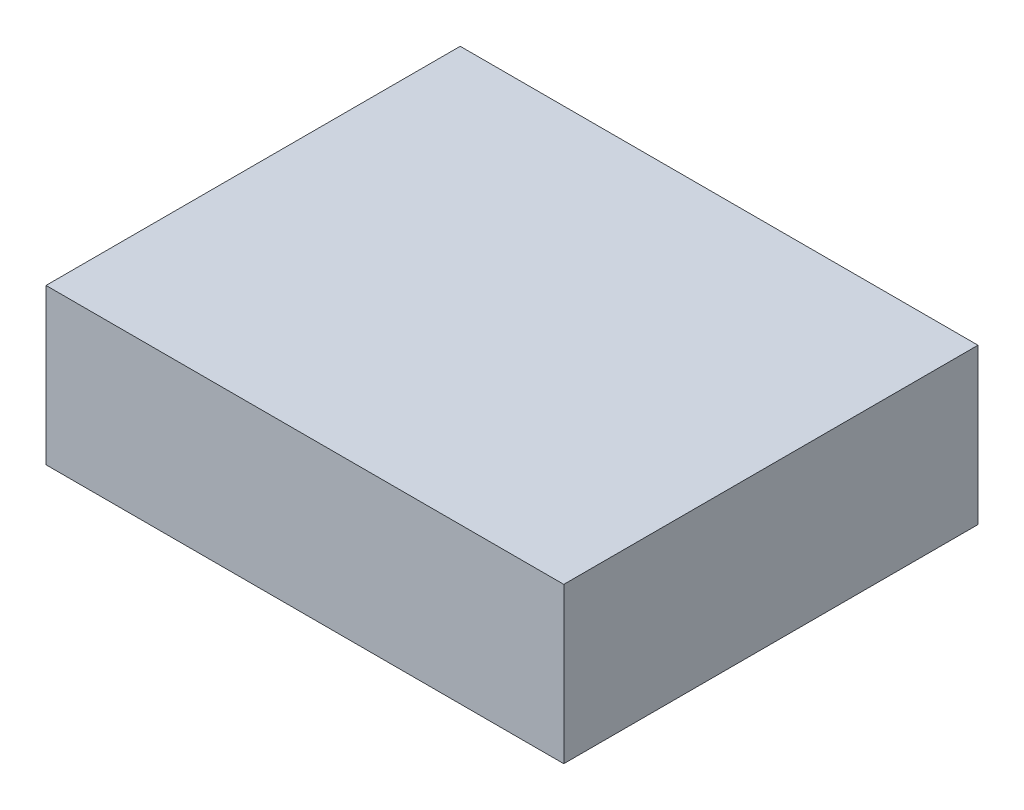
ISO-10303-21;
HEADER;
FILE_DESCRIPTION(('STEP AP214'),'2;1');
FILE_NAME('part.step','',(''),(''),'','','');
FILE_SCHEMA(('AUTOMOTIVE_DESIGN { 1 0 10303 214 1 1 1 1 }'));
ENDSEC;
DATA;
#1=APPLICATION_CONTEXT('core data for automotive mechanical design processes');
#2=APPLICATION_PROTOCOL_DEFINITION('international standard','automotive_design',2000,#1);
#3=PRODUCT_CONTEXT('',#1,'mechanical');
#4=PRODUCT('Part','Part','',(#3));
#5=PRODUCT_RELATED_PRODUCT_CATEGORY('part','',(#4));
#6=PRODUCT_DEFINITION_FORMATION('','',#4);
#7=PRODUCT_DEFINITION_CONTEXT('part definition',#1,'design');
#8=PRODUCT_DEFINITION('design','',#6,#7);
#9=PRODUCT_DEFINITION_SHAPE('','',#8);
#10=(LENGTH_UNIT() NAMED_UNIT(*) SI_UNIT(.MILLI.,.METRE.));
#11=(NAMED_UNIT(*) PLANE_ANGLE_UNIT() SI_UNIT($,.RADIAN.));
#12=(NAMED_UNIT(*) SI_UNIT($,.STERADIAN.) SOLID_ANGLE_UNIT());
#13=UNCERTAINTY_MEASURE_WITH_UNIT(LENGTH_MEASURE(1.E-05),#10,'distance_accuracy_value','');
#14=(GEOMETRIC_REPRESENTATION_CONTEXT(3) GLOBAL_UNCERTAINTY_ASSIGNED_CONTEXT((#13)) GLOBAL_UNIT_ASSIGNED_CONTEXT((#10,
#11,#12)) REPRESENTATION_CONTEXT('',''));
#15=CARTESIAN_POINT('',(0.,0.,0.));
#16=DIRECTION('',(0.,0.,1.));
#17=DIRECTION('',(1.,0.,0.));
#18=AXIS2_PLACEMENT_3D('',#15,#16,#17);
#19=CARTESIAN_POINT('',(-50.,30.,40.));
#20=DIRECTION('',(1.,0.,0.));
#21=DIRECTION('',(0.,0.,-1.));
#22=AXIS2_PLACEMENT_3D('',#19,#20,#21);
#23=PLANE('',#22);
#24=DIRECTION('',(0.,0.,1.));
#25=VECTOR('',#24,1.);
#26=CARTESIAN_POINT('',(-50.,0.,40.));
#27=LINE('',#26,#25);
#28=CARTESIAN_POINT('',(-50.,0.,-40.));
#29=VERTEX_POINT('',#28);
#30=CARTESIAN_POINT('',(-50.,0.,40.));
#31=VERTEX_POINT('',#30);
#32=EDGE_CURVE('E96',#29,#31,#27,.T.);
#33=ORIENTED_EDGE('',*,*,#32,.T.);
#34=DIRECTION('',(0.,-1.,0.));
#35=VECTOR('',#34,1.);
#36=CARTESIAN_POINT('',(-50.,30.,40.));
#37=LINE('',#36,#35);
#38=CARTESIAN_POINT('',(-50.,30.,40.));
#39=VERTEX_POINT('',#38);
#40=EDGE_CURVE('E11',#39,#31,#37,.T.);
#41=ORIENTED_EDGE('',*,*,#40,.F.);
#42=DIRECTION('',(0.,0.,1.));
#43=VECTOR('',#42,1.);
#44=CARTESIAN_POINT('',(-50.,30.,40.));
#45=LINE('',#44,#43);
#46=CARTESIAN_POINT('',(-50.,30.,-40.));
#47=VERTEX_POINT('',#46);
#48=EDGE_CURVE('E84',#47,#39,#45,.T.);
#49=ORIENTED_EDGE('',*,*,#48,.F.);
#50=DIRECTION('',(0.,-1.,0.));
#51=VECTOR('',#50,1.);
#52=CARTESIAN_POINT('',(-50.,30.,-40.));
#53=LINE('',#52,#51);
#54=EDGE_CURVE('E92',#47,#29,#53,.T.);
#55=ORIENTED_EDGE('',*,*,#54,.T.);
#56=EDGE_LOOP('',(#33,#41,#49,#55));
#57=FACE_BOUND('',#56,.T.);
#58=ADVANCED_FACE('F33',(#57),#23,.F.);
#59=CARTESIAN_POINT('',(50.,30.,40.));
#60=DIRECTION('',(0.,0.,-1.));
#61=DIRECTION('',(-1.,0.,0.));
#62=AXIS2_PLACEMENT_3D('',#59,#60,#61);
#63=PLANE('',#62);
#64=DIRECTION('',(1.,0.,0.));
#65=VECTOR('',#64,1.);
#66=CARTESIAN_POINT('',(50.,0.,40.));
#67=LINE('',#66,#65);
#68=CARTESIAN_POINT('',(50.,0.,40.));
#69=VERTEX_POINT('',#68);
#70=EDGE_CURVE('E88',#31,#69,#67,.T.);
#71=ORIENTED_EDGE('',*,*,#70,.T.);
#72=DIRECTION('',(0.,-1.,0.));
#73=VECTOR('',#72,1.);
#74=CARTESIAN_POINT('',(50.,30.,40.));
#75=LINE('',#74,#73);
#76=CARTESIAN_POINT('',(50.,30.,40.));
#77=VERTEX_POINT('',#76);
#78=EDGE_CURVE('E41',#77,#69,#75,.T.);
#79=ORIENTED_EDGE('',*,*,#78,.F.);
#80=DIRECTION('',(1.,0.,0.));
#81=VECTOR('',#80,1.);
#82=CARTESIAN_POINT('',(50.,30.,40.));
#83=LINE('',#82,#81);
#84=EDGE_CURVE('E79',#39,#77,#83,.T.);
#85=ORIENTED_EDGE('',*,*,#84,.F.);
#86=ORIENTED_EDGE('',*,*,#40,.T.);
#87=EDGE_LOOP('',(#71,#79,#85,#86));
#88=FACE_BOUND('',#87,.T.);
#89=ADVANCED_FACE('F87',(#88),#63,.F.);
#90=CARTESIAN_POINT('',(50.,30.,40.));
#91=DIRECTION('',(-1.,0.,0.));
#92=DIRECTION('',(0.,0.,1.));
#93=AXIS2_PLACEMENT_3D('',#90,#91,#92);
#94=PLANE('',#93);
#95=DIRECTION('',(0.,0.,-1.));
#96=VECTOR('',#95,1.);
#97=CARTESIAN_POINT('',(50.,0.,40.));
#98=LINE('',#97,#96);
#99=CARTESIAN_POINT('',(50.,0.,-40.));
#100=VERTEX_POINT('',#99);
#101=EDGE_CURVE('E66',#69,#100,#98,.T.);
#102=ORIENTED_EDGE('',*,*,#101,.T.);
#103=DIRECTION('',(0.,-1.,0.));
#104=VECTOR('',#103,1.);
#105=CARTESIAN_POINT('',(50.,30.,-40.));
#106=LINE('',#105,#104);
#107=CARTESIAN_POINT('',(50.,30.,-40.));
#108=VERTEX_POINT('',#107);
#109=EDGE_CURVE('E89',#108,#100,#106,.T.);
#110=ORIENTED_EDGE('',*,*,#109,.F.);
#111=DIRECTION('',(0.,0.,-1.));
#112=VECTOR('',#111,1.);
#113=CARTESIAN_POINT('',(50.,30.,40.));
#114=LINE('',#113,#112);
#115=EDGE_CURVE('E82',#77,#108,#114,.T.);
#116=ORIENTED_EDGE('',*,*,#115,.F.);
#117=ORIENTED_EDGE('',*,*,#78,.T.);
#118=EDGE_LOOP('',(#102,#110,#116,#117));
#119=FACE_BOUND('',#118,.T.);
#120=ADVANCED_FACE('F90',(#119),#94,.F.);
#121=CARTESIAN_POINT('',(50.,30.,-40.));
#122=DIRECTION('',(0.,0.,1.));
#123=DIRECTION('',(1.,0.,0.));
#124=AXIS2_PLACEMENT_3D('',#121,#122,#123);
#125=PLANE('',#124);
#126=DIRECTION('',(-1.,0.,0.));
#127=VECTOR('',#126,1.);
#128=CARTESIAN_POINT('',(50.,0.,-40.));
#129=LINE('',#128,#127);
#130=EDGE_CURVE('E72',#100,#29,#129,.T.);
#131=ORIENTED_EDGE('',*,*,#130,.T.);
#132=ORIENTED_EDGE('',*,*,#54,.F.);
#133=DIRECTION('',(-1.,0.,0.));
#134=VECTOR('',#133,1.);
#135=CARTESIAN_POINT('',(50.,30.,-40.));
#136=LINE('',#135,#134);
#137=EDGE_CURVE('E49',#108,#47,#136,.T.);
#138=ORIENTED_EDGE('',*,*,#137,.F.);
#139=ORIENTED_EDGE('',*,*,#109,.T.);
#140=EDGE_LOOP('',(#131,#132,#138,#139));
#141=FACE_BOUND('',#140,.T.);
#142=ADVANCED_FACE('F103',(#141),#125,.F.);
#143=CARTESIAN_POINT('',(0.,30.,0.));
#144=DIRECTION('',(0.,1.,0.));
#145=DIRECTION('',(0.,0.,1.));
#146=AXIS2_PLACEMENT_3D('',#143,#144,#145);
#147=PLANE('',#146);
#148=ORIENTED_EDGE('',*,*,#48,.T.);
#149=ORIENTED_EDGE('',*,*,#84,.T.);
#150=ORIENTED_EDGE('',*,*,#115,.T.);
#151=ORIENTED_EDGE('',*,*,#137,.T.);
#152=EDGE_LOOP('',(#148,#149,#150,#151));
#153=FACE_BOUND('',#152,.T.);
#154=ADVANCED_FACE('F80',(#153),#147,.T.);
#155=CARTESIAN_POINT('',(0.,0.,0.));
#156=DIRECTION('',(0.,1.,0.));
#157=DIRECTION('',(0.,0.,1.));
#158=AXIS2_PLACEMENT_3D('',#155,#156,#157);
#159=PLANE('',#158);
#160=ORIENTED_EDGE('',*,*,#32,.F.);
#161=ORIENTED_EDGE('',*,*,#130,.F.);
#162=ORIENTED_EDGE('',*,*,#101,.F.);
#163=ORIENTED_EDGE('',*,*,#70,.F.);
#164=EDGE_LOOP('',(#160,#161,#162,#163));
#165=FACE_BOUND('',#164,.T.);
#166=ADVANCED_FACE('F106',(#165),#159,.F.);
#167=CLOSED_SHELL('',(#58,#89,#120,#142,#154,#166));
#168=MANIFOLD_SOLID_BREP('B2',#167);
#169=ADVANCED_BREP_SHAPE_REPRESENTATION('',(#18,#168),#14);
#170=SHAPE_DEFINITION_REPRESENTATION(#9,#169);
ENDSEC;
END-ISO-10303-21;
